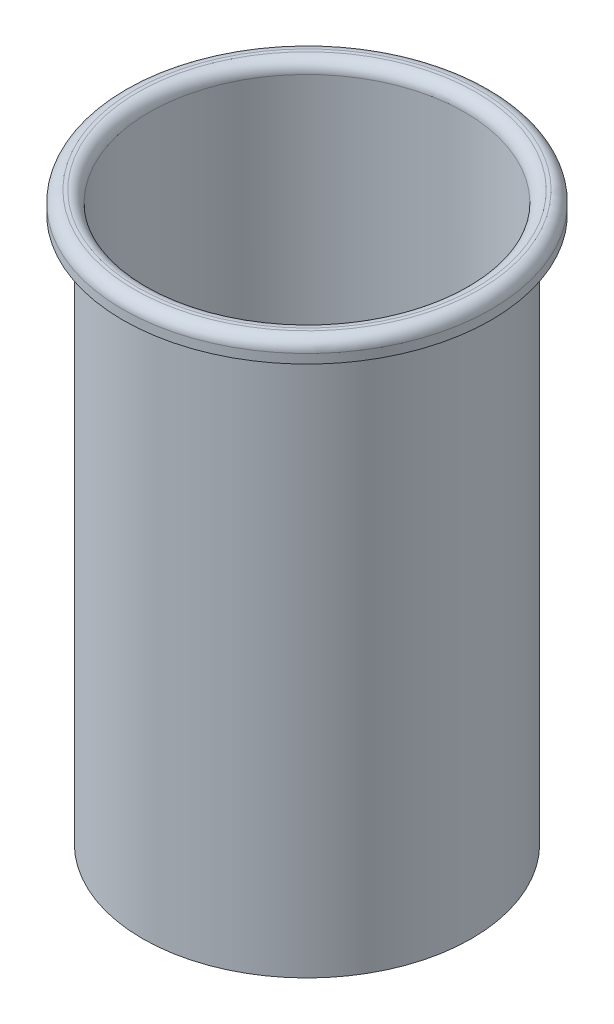
ISO-10303-21;
HEADER;
FILE_DESCRIPTION(('STEP AP214'),'2;1');
FILE_NAME('part.step','',(''),(''),'','','');
FILE_SCHEMA(('AUTOMOTIVE_DESIGN { 1 0 10303 214 1 1 1 1 }'));
ENDSEC;
DATA;
#1=APPLICATION_CONTEXT('core data for automotive mechanical design processes');
#2=APPLICATION_PROTOCOL_DEFINITION('international standard','automotive_design',2000,#1);
#3=PRODUCT_CONTEXT('',#1,'mechanical');
#4=PRODUCT('Part','Part','',(#3));
#5=PRODUCT_RELATED_PRODUCT_CATEGORY('part','',(#4));
#6=PRODUCT_DEFINITION_FORMATION('','',#4);
#7=PRODUCT_DEFINITION_CONTEXT('part definition',#1,'design');
#8=PRODUCT_DEFINITION('design','',#6,#7);
#9=PRODUCT_DEFINITION_SHAPE('','',#8);
#10=(LENGTH_UNIT() NAMED_UNIT(*) SI_UNIT(.MILLI.,.METRE.));
#11=(NAMED_UNIT(*) PLANE_ANGLE_UNIT() SI_UNIT($,.RADIAN.));
#12=(NAMED_UNIT(*) SI_UNIT($,.STERADIAN.) SOLID_ANGLE_UNIT());
#13=UNCERTAINTY_MEASURE_WITH_UNIT(LENGTH_MEASURE(1.E-05),#10,'distance_accuracy_value','');
#14=(GEOMETRIC_REPRESENTATION_CONTEXT(3) GLOBAL_UNCERTAINTY_ASSIGNED_CONTEXT((#13)) GLOBAL_UNIT_ASSIGNED_CONTEXT((#10,
#11,#12)) REPRESENTATION_CONTEXT('',''));
#15=CARTESIAN_POINT('',(0.,0.,0.));
#16=DIRECTION('',(0.,0.,1.));
#17=DIRECTION('',(1.,0.,0.));
#18=AXIS2_PLACEMENT_3D('',#15,#16,#17);
#19=CARTESIAN_POINT('',(0.,0.,0.));
#20=DIRECTION('',(0.,1.,0.));
#21=DIRECTION('',(0.,0.,1.));
#22=AXIS2_PLACEMENT_3D('',#19,#20,#21);
#23=PLANE('',#22);
#24=CARTESIAN_POINT('',(0.,0.,0.));
#25=DIRECTION('',(0.,1.,0.));
#26=DIRECTION('',(0.,0.,1.));
#27=AXIS2_PLACEMENT_3D('',#24,#25,#26);
#28=CIRCLE('',#27,223.8375);
#29=CARTESIAN_POINT('',(0.,0.,223.8375));
#30=VERTEX_POINT('',#29);
#31=EDGE_CURVE('P0_E17',#30,#30,#28,.T.);
#32=ORIENTED_EDGE('',*,*,#31,.T.);
#33=EDGE_LOOP('',(#32));
#34=FACE_BOUND('',#33,.T.);
#35=ADVANCED_FACE('P0_F14',(#34),#23,.T.);
#36=CARTESIAN_POINT('',(0.,0.,0.));
#37=DIRECTION('',(0.,1.,0.));
#38=DIRECTION('',(0.,0.,1.));
#39=AXIS2_PLACEMENT_3D('',#36,#37,#38);
#40=CYLINDRICAL_SURFACE('',#39,223.8375);
#41=ORIENTED_EDGE('',*,*,#31,.F.);
#42=EDGE_LOOP('',(#41));
#43=FACE_BOUND('',#42,.T.);
#44=CARTESIAN_POINT('',(0.,749.3,0.));
#45=DIRECTION('',(0.,1.,0.));
#46=DIRECTION('',(0.,0.,1.));
#47=AXIS2_PLACEMENT_3D('',#44,#45,#46);
#48=CIRCLE('',#47,223.8375);
#49=CARTESIAN_POINT('',(0.,749.3,223.8375));
#50=VERTEX_POINT('',#49);
#51=EDGE_CURVE('P0_E26',#50,#50,#48,.F.);
#52=ORIENTED_EDGE('',*,*,#51,.F.);
#53=EDGE_LOOP('',(#52));
#54=FACE_BOUND('',#53,.T.);
#55=ADVANCED_FACE('P0_F35',(#43,#54),#40,.F.);
#56=CARTESIAN_POINT('',(0.,-3.175,0.));
#57=DIRECTION('',(0.,1.,0.));
#58=DIRECTION('',(0.,0.,1.));
#59=AXIS2_PLACEMENT_3D('',#56,#57,#58);
#60=PLANE('',#59);
#61=CARTESIAN_POINT('',(0.,-3.175,0.));
#62=DIRECTION('',(0.,1.,0.));
#63=DIRECTION('',(0.,0.,1.));
#64=AXIS2_PLACEMENT_3D('',#61,#62,#63);
#65=CIRCLE('',#64,227.0125);
#66=CARTESIAN_POINT('',(0.,-3.175,227.0125));
#67=VERTEX_POINT('',#66);
#68=EDGE_CURVE('P0_E21',#67,#67,#65,.T.);
#69=ORIENTED_EDGE('',*,*,#68,.F.);
#70=EDGE_LOOP('',(#69));
#71=FACE_BOUND('',#70,.T.);
#72=ADVANCED_FACE('P0_F38',(#71),#60,.F.);
#73=CARTESIAN_POINT('',(0.,749.3,0.));
#74=DIRECTION('',(0.,1.,0.));
#75=DIRECTION('',(0.,0.,1.));
#76=AXIS2_PLACEMENT_3D('',#73,#74,#75);
#77=PLANE('',#76);
#78=ORIENTED_EDGE('',*,*,#51,.T.);
#79=EDGE_LOOP('',(#78));
#80=FACE_BOUND('',#79,.T.);
#81=CARTESIAN_POINT('',(0.,749.3,0.));
#82=DIRECTION('',(0.,1.,0.));
#83=DIRECTION('',(0.,0.,1.));
#84=AXIS2_PLACEMENT_3D('',#81,#82,#83);
#85=CIRCLE('',#84,227.0125);
#86=CARTESIAN_POINT('',(0.,749.3,227.0125));
#87=VERTEX_POINT('',#86);
#88=EDGE_CURVE('P0_E10',#87,#87,#85,.F.);
#89=ORIENTED_EDGE('',*,*,#88,.F.);
#90=EDGE_LOOP('',(#89));
#91=FACE_BOUND('',#90,.T.);
#92=ADVANCED_FACE('P0_F44',(#80,#91),#77,.T.);
#93=CARTESIAN_POINT('',(0.,0.,0.));
#94=DIRECTION('',(0.,1.,0.));
#95=DIRECTION('',(0.,0.,1.));
#96=AXIS2_PLACEMENT_3D('',#93,#94,#95);
#97=CYLINDRICAL_SURFACE('',#96,227.0125);
#98=ORIENTED_EDGE('',*,*,#68,.T.);
#99=EDGE_LOOP('',(#98));
#100=FACE_BOUND('',#99,.T.);
#101=ORIENTED_EDGE('',*,*,#88,.T.);
#102=EDGE_LOOP('',(#101));
#103=FACE_BOUND('',#102,.T.);
#104=ADVANCED_FACE('P0_F47',(#100,#103),#97,.T.);
#105=CLOSED_SHELL('',(#35,#55,#72,#92,#104));
#106=MANIFOLD_SOLID_BREP('P0_B1',#105);
#107=CARTESIAN_POINT('',(0.,6.35,0.));
#108=DIRECTION('',(0.,1.,0.));
#109=DIRECTION('',(0.,0.,1.));
#110=AXIS2_PLACEMENT_3D('',#107,#108,#109);
#111=PLANE('',#110);
#112=CARTESIAN_POINT('',(0.,6.34999999999997,0.));
#113=DIRECTION('',(0.,1.,0.));
#114=DIRECTION('',(0.,0.,1.));
#115=AXIS2_PLACEMENT_3D('',#112,#113,#114);
#116=CIRCLE('',#115,217.4875);
#117=CARTESIAN_POINT('',(0.,6.34999999999997,217.4875));
#118=VERTEX_POINT('',#117);
#119=EDGE_CURVE('P1_E229',#118,#118,#116,.T.);
#120=ORIENTED_EDGE('',*,*,#119,.T.);
#121=EDGE_LOOP('',(#120));
#122=FACE_BOUND('',#121,.T.);
#123=ADVANCED_FACE('P1_F16',(#122),#111,.T.);
#124=CARTESIAN_POINT('',(0.,774.7,0.));
#125=DIRECTION('',(0.,1.,0.));
#126=DIRECTION('',(0.,0.,1.));
#127=AXIS2_PLACEMENT_3D('',#124,#125,#126);
#128=CYLINDRICAL_SURFACE('',#127,217.4875);
#129=ORIENTED_EDGE('',*,*,#119,.F.);
#130=EDGE_LOOP('',(#129));
#131=FACE_BOUND('',#130,.T.);
#132=CARTESIAN_POINT('',(0.,762.,0.));
#133=DIRECTION('',(0.,1.,0.));
#134=DIRECTION('',(-0.0103980013435095,0.,-0.999945939322752));
#135=AXIS2_PLACEMENT_3D('',#132,#133,#134);
#136=CIRCLE('',#135,217.4875);
#137=CARTESIAN_POINT('',(-2.26143531719652,762.,-217.475742478457));
#138=VERTEX_POINT('',#137);
#139=EDGE_CURVE('P1_E69',#138,#138,#136,.F.);
#140=ORIENTED_EDGE('',*,*,#139,.F.);
#141=EDGE_LOOP('',(#140));
#142=FACE_BOUND('',#141,.T.);
#143=ADVANCED_FACE('P1_F263',(#131,#142),#128,.F.);
#144=CARTESIAN_POINT('',(0.,762.,0.));
#145=DIRECTION('',(0.,1.,0.));
#146=DIRECTION('',(-0.0103980013435095,0.,-0.999945939322752));
#147=AXIS2_PLACEMENT_3D('',#144,#145,#146);
#148=TOROIDAL_SURFACE('',#147,233.3625,15.875);
#149=ORIENTED_EDGE('',*,*,#139,.T.);
#150=EDGE_LOOP('',(#149));
#151=FACE_BOUND('',#150,.T.);
#152=CARTESIAN_POINT('',(0.,777.875,0.));
#153=DIRECTION('',(0.,1.,0.));
#154=DIRECTION('',(0.,0.,1.));
#155=AXIS2_PLACEMENT_3D('',#152,#153,#154);
#156=CIRCLE('',#155,233.3625);
#157=CARTESIAN_POINT('',(0.,777.875,-233.3625));
#158=VERTEX_POINT('',#157);
#159=CARTESIAN_POINT('',(0.,777.875,233.3625));
#160=VERTEX_POINT('',#159);
#161=EDGE_CURVE('P1_E58',#158,#160,#156,.F.);
#162=ORIENTED_EDGE('',*,*,#161,.F.);
#163=CARTESIAN_POINT('',(0.,777.875,0.));
#164=DIRECTION('',(0.,1.,0.));
#165=DIRECTION('',(0.,0.,-1.));
#166=AXIS2_PLACEMENT_3D('',#163,#164,#165);
#167=CIRCLE('',#166,233.3625);
#168=EDGE_CURVE('P1_E56',#160,#158,#167,.F.);
#169=ORIENTED_EDGE('',*,*,#168,.F.);
#170=EDGE_LOOP('',(#162,#169));
#171=FACE_BOUND('',#170,.T.);
#172=ADVANCED_FACE('P1_F60',(#151,#171),#148,.T.);
#173=CARTESIAN_POINT('',(0.,777.875,0.));
#174=DIRECTION('',(0.,1.,0.));
#175=DIRECTION('',(0.,0.,1.));
#176=AXIS2_PLACEMENT_3D('',#173,#174,#175);
#177=PLANE('',#176);
#178=ORIENTED_EDGE('',*,*,#168,.T.);
#179=ORIENTED_EDGE('',*,*,#161,.T.);
#180=EDGE_LOOP('',(#178,#179));
#181=FACE_BOUND('',#180,.T.);
#182=CARTESIAN_POINT('',(0.,777.875,0.));
#183=DIRECTION('',(0.,-1.,0.));
#184=DIRECTION('',(1.,0.,0.));
#185=AXIS2_PLACEMENT_3D('',#182,#183,#184);
#186=CIRCLE('',#185,238.125);
#187=CARTESIAN_POINT('',(238.125,777.875,0.));
#188=VERTEX_POINT('',#187);
#189=CARTESIAN_POINT('',(-238.125,777.875,0.));
#190=VERTEX_POINT('',#189);
#191=EDGE_CURVE('P1_E111',#188,#190,#186,.T.);
#192=ORIENTED_EDGE('',*,*,#191,.F.);
#193=CARTESIAN_POINT('',(0.,777.875,0.));
#194=DIRECTION('',(0.,-1.,0.));
#195=DIRECTION('',(-1.,0.,0.));
#196=AXIS2_PLACEMENT_3D('',#193,#194,#195);
#197=CIRCLE('',#196,238.125);
#198=EDGE_CURVE('P1_E63',#190,#188,#197,.T.);
#199=ORIENTED_EDGE('',*,*,#198,.F.);
#200=EDGE_LOOP('',(#192,#199));
#201=FACE_BOUND('',#200,.T.);
#202=ADVANCED_FACE('P1_F67',(#181,#201),#177,.T.);
#203=CARTESIAN_POINT('',(0.,762.,0.));
#204=DIRECTION('',(0.,1.,0.));
#205=DIRECTION('',(-0.999979266012991,0.,-0.00643952980572294));
#206=AXIS2_PLACEMENT_3D('',#203,#204,#205);
#207=TOROIDAL_SURFACE('',#206,238.125,15.875);
#208=CARTESIAN_POINT('',(0.,762.,0.));
#209=DIRECTION('',(0.,1.,0.));
#210=DIRECTION('',(0.,0.,1.));
#211=AXIS2_PLACEMENT_3D('',#208,#209,#210);
#212=CIRCLE('',#211,254.);
#213=CARTESIAN_POINT('',(0.,762.,254.));
#214=VERTEX_POINT('',#213);
#215=EDGE_CURVE('P1_E121',#214,#214,#212,.F.);
#216=ORIENTED_EDGE('',*,*,#215,.F.);
#217=EDGE_LOOP('',(#216));
#218=FACE_BOUND('',#217,.T.);
#219=ORIENTED_EDGE('',*,*,#191,.T.);
#220=ORIENTED_EDGE('',*,*,#198,.T.);
#221=EDGE_LOOP('',(#219,#220));
#222=FACE_BOUND('',#221,.T.);
#223=ADVANCED_FACE('P1_F87',(#218,#222),#207,.T.);
#224=CARTESIAN_POINT('',(0.,774.7,0.));
#225=DIRECTION('',(0.,1.,0.));
#226=DIRECTION('',(0.,0.,1.));
#227=AXIS2_PLACEMENT_3D('',#224,#225,#226);
#228=CYLINDRICAL_SURFACE('',#227,254.);
#229=CARTESIAN_POINT('',(0.,749.3,0.));
#230=DIRECTION('',(0.,1.,0.));
#231=DIRECTION('',(0.,0.,1.));
#232=AXIS2_PLACEMENT_3D('',#229,#230,#231);
#233=CIRCLE('',#232,254.);
#234=CARTESIAN_POINT('',(0.,749.3,254.));
#235=VERTEX_POINT('',#234);
#236=EDGE_CURVE('P1_E123',#235,#235,#233,.T.);
#237=ORIENTED_EDGE('',*,*,#236,.T.);
#238=EDGE_LOOP('',(#237));
#239=FACE_BOUND('',#238,.T.);
#240=ORIENTED_EDGE('',*,*,#215,.T.);
#241=EDGE_LOOP('',(#240));
#242=FACE_BOUND('',#241,.T.);
#243=ADVANCED_FACE('P1_F310',(#239,#242),#228,.T.);
#244=CARTESIAN_POINT('',(0.,749.3,0.));
#245=DIRECTION('',(0.,1.,0.));
#246=DIRECTION('',(0.,0.,1.));
#247=AXIS2_PLACEMENT_3D('',#244,#245,#246);
#248=PLANE('',#247);
#249=CARTESIAN_POINT('',(0.,749.3,0.));
#250=DIRECTION('',(0.,1.,0.));
#251=DIRECTION('',(0.,0.,1.));
#252=AXIS2_PLACEMENT_3D('',#249,#250,#251);
#253=CIRCLE('',#252,250.825);
#254=CARTESIAN_POINT('',(0.,749.3,250.825));
#255=VERTEX_POINT('',#254);
#256=EDGE_CURVE('P1_E128',#255,#255,#253,.T.);
#257=ORIENTED_EDGE('',*,*,#256,.T.);
#258=EDGE_LOOP('',(#257));
#259=FACE_BOUND('',#258,.T.);
#260=ORIENTED_EDGE('',*,*,#236,.F.);
#261=EDGE_LOOP('',(#260));
#262=FACE_BOUND('',#261,.T.);
#263=ADVANCED_FACE('P1_F303',(#259,#262),#248,.F.);
#264=CARTESIAN_POINT('',(0.,774.7,0.));
#265=DIRECTION('',(0.,1.,0.));
#266=DIRECTION('',(0.,0.,1.));
#267=AXIS2_PLACEMENT_3D('',#264,#265,#266);
#268=CYLINDRICAL_SURFACE('',#267,250.825);
#269=CARTESIAN_POINT('',(0.,762.,0.));
#270=DIRECTION('',(0.,1.,0.));
#271=DIRECTION('',(-0.999979266012992,0.,-0.00643952980572295));
#272=AXIS2_PLACEMENT_3D('',#269,#270,#271);
#273=CIRCLE('',#272,250.825);
#274=CARTESIAN_POINT('',(-250.819799397709,762.,-1.61519506352046));
#275=VERTEX_POINT('',#274);
#276=EDGE_CURVE('P1_E132',#275,#275,#273,.T.);
#277=ORIENTED_EDGE('',*,*,#276,.T.);
#278=EDGE_LOOP('',(#277));
#279=FACE_BOUND('',#278,.T.);
#280=ORIENTED_EDGE('',*,*,#256,.F.);
#281=EDGE_LOOP('',(#280));
#282=FACE_BOUND('',#281,.T.);
#283=ADVANCED_FACE('P1_F152',(#279,#282),#268,.F.);
#284=CARTESIAN_POINT('',(0.,762.,0.));
#285=DIRECTION('',(0.,1.,0.));
#286=DIRECTION('',(-0.999979266012991,0.,-0.00643952980572294));
#287=AXIS2_PLACEMENT_3D('',#284,#285,#286);
#288=TOROIDAL_SURFACE('',#287,238.125,12.7);
#289=ORIENTED_EDGE('',*,*,#276,.F.);
#290=EDGE_LOOP('',(#289));
#291=FACE_BOUND('',#290,.T.);
#292=CARTESIAN_POINT('',(0.,774.7,0.));
#293=DIRECTION('',(0.,1.,0.));
#294=DIRECTION('',(1.,0.,0.));
#295=AXIS2_PLACEMENT_3D('',#292,#293,#294);
#296=CIRCLE('',#295,238.125);
#297=CARTESIAN_POINT('',(238.125,774.7,0.));
#298=VERTEX_POINT('',#297);
#299=CARTESIAN_POINT('',(-238.125,774.7,0.));
#300=VERTEX_POINT('',#299);
#301=EDGE_CURVE('P1_E135',#298,#300,#296,.T.);
#302=ORIENTED_EDGE('',*,*,#301,.T.);
#303=CARTESIAN_POINT('',(0.,774.7,0.));
#304=DIRECTION('',(0.,1.,0.));
#305=DIRECTION('',(-1.,0.,0.));
#306=AXIS2_PLACEMENT_3D('',#303,#304,#305);
#307=CIRCLE('',#306,238.125);
#308=EDGE_CURVE('P1_E194',#300,#298,#307,.T.);
#309=ORIENTED_EDGE('',*,*,#308,.T.);
#310=EDGE_LOOP('',(#302,#309));
#311=FACE_BOUND('',#310,.T.);
#312=ADVANCED_FACE('P1_F141',(#291,#311),#288,.F.);
#313=CARTESIAN_POINT('',(0.,774.7,0.));
#314=DIRECTION('',(0.,1.,0.));
#315=DIRECTION('',(0.,0.,1.));
#316=AXIS2_PLACEMENT_3D('',#313,#314,#315);
#317=PLANE('',#316);
#318=CARTESIAN_POINT('',(0.,774.7,0.));
#319=DIRECTION('',(0.,-1.,0.));
#320=DIRECTION('',(0.,0.,-1.));
#321=AXIS2_PLACEMENT_3D('',#318,#319,#320);
#322=CIRCLE('',#321,233.3625);
#323=CARTESIAN_POINT('',(0.,774.7,233.3625));
#324=VERTEX_POINT('',#323);
#325=CARTESIAN_POINT('',(0.,774.7,-233.3625));
#326=VERTEX_POINT('',#325);
#327=EDGE_CURVE('P1_E204',#324,#326,#322,.F.);
#328=ORIENTED_EDGE('',*,*,#327,.T.);
#329=CARTESIAN_POINT('',(0.,774.7,0.));
#330=DIRECTION('',(0.,-1.,0.));
#331=DIRECTION('',(0.,0.,1.));
#332=AXIS2_PLACEMENT_3D('',#329,#330,#331);
#333=CIRCLE('',#332,233.3625);
#334=EDGE_CURVE('P1_E35',#326,#324,#333,.F.);
#335=ORIENTED_EDGE('',*,*,#334,.T.);
#336=EDGE_LOOP('',(#328,#335));
#337=FACE_BOUND('',#336,.T.);
#338=ORIENTED_EDGE('',*,*,#301,.F.);
#339=ORIENTED_EDGE('',*,*,#308,.F.);
#340=EDGE_LOOP('',(#338,#339));
#341=FACE_BOUND('',#340,.T.);
#342=ADVANCED_FACE('P1_F151',(#337,#341),#317,.F.);
#343=CARTESIAN_POINT('',(0.,3.175,0.));
#344=DIRECTION('',(0.,1.,0.));
#345=DIRECTION('',(0.,0.,1.));
#346=AXIS2_PLACEMENT_3D('',#343,#344,#345);
#347=PLANE('',#346);
#348=CARTESIAN_POINT('',(0.,3.17500000000004,0.));
#349=DIRECTION('',(0.,1.,0.));
#350=DIRECTION('',(0.,0.,1.));
#351=AXIS2_PLACEMENT_3D('',#348,#349,#350);
#352=CIRCLE('',#351,220.6625);
#353=CARTESIAN_POINT('',(0.,3.17500000000004,220.6625));
#354=VERTEX_POINT('',#353);
#355=EDGE_CURVE('P1_E27',#354,#354,#352,.T.);
#356=ORIENTED_EDGE('',*,*,#355,.F.);
#357=EDGE_LOOP('',(#356));
#358=FACE_BOUND('',#357,.T.);
#359=ADVANCED_FACE('P1_F176',(#358),#347,.F.);
#360=CARTESIAN_POINT('',(0.,762.,0.));
#361=DIRECTION('',(0.,1.,0.));
#362=DIRECTION('',(0.0103980013435095,0.,0.999945939322752));
#363=AXIS2_PLACEMENT_3D('',#360,#361,#362);
#364=TOROIDAL_SURFACE('',#363,233.3625,12.7);
#365=CARTESIAN_POINT('',(0.,762.,0.));
#366=DIRECTION('',(0.,1.,0.));
#367=DIRECTION('',(0.,0.,1.));
#368=AXIS2_PLACEMENT_3D('',#365,#366,#367);
#369=CIRCLE('',#368,220.6625);
#370=CARTESIAN_POINT('',(0.,762.,220.6625));
#371=VERTEX_POINT('',#370);
#372=EDGE_CURVE('P1_E11',#371,#371,#369,.F.);
#373=ORIENTED_EDGE('',*,*,#372,.F.);
#374=EDGE_LOOP('',(#373));
#375=FACE_BOUND('',#374,.T.);
#376=ORIENTED_EDGE('',*,*,#327,.F.);
#377=ORIENTED_EDGE('',*,*,#334,.F.);
#378=EDGE_LOOP('',(#376,#377));
#379=FACE_BOUND('',#378,.T.);
#380=ADVANCED_FACE('P1_F165',(#375,#379),#364,.F.);
#381=CARTESIAN_POINT('',(0.,774.7,0.));
#382=DIRECTION('',(0.,1.,0.));
#383=DIRECTION('',(0.,0.,1.));
#384=AXIS2_PLACEMENT_3D('',#381,#382,#383);
#385=CYLINDRICAL_SURFACE('',#384,220.6625);
#386=ORIENTED_EDGE('',*,*,#355,.T.);
#387=EDGE_LOOP('',(#386));
#388=FACE_BOUND('',#387,.T.);
#389=ORIENTED_EDGE('',*,*,#372,.T.);
#390=EDGE_LOOP('',(#389));
#391=FACE_BOUND('',#390,.T.);
#392=ADVANCED_FACE('P1_F175',(#388,#391),#385,.T.);
#393=CLOSED_SHELL('',(#123,#143,#172,#202,#223,#243,#263,#283,#312,#342,#359,#380,#392));
#394=MANIFOLD_SOLID_BREP('P1_B1',#393);
#395=ADVANCED_BREP_SHAPE_REPRESENTATION('',(#18,#106,#394),#14);
#396=SHAPE_DEFINITION_REPRESENTATION(#9,#395);
ENDSEC;
END-ISO-10303-21;
